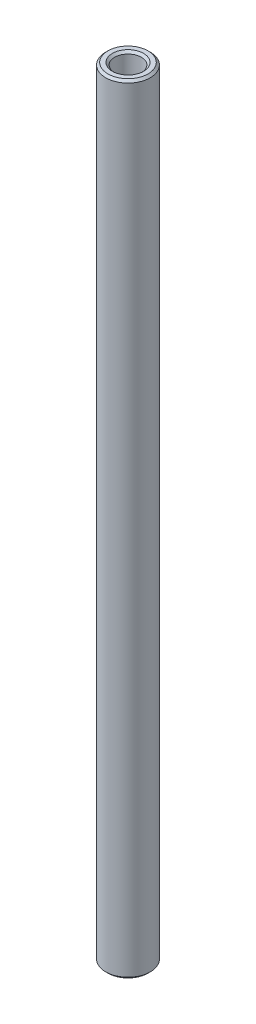
ISO-10303-21;
HEADER;
FILE_DESCRIPTION(('STEP AP214'),'2;1');
FILE_NAME('part.step','',(''),(''),'','','');
FILE_SCHEMA(('AUTOMOTIVE_DESIGN { 1 0 10303 214 1 1 1 1 }'));
ENDSEC;
DATA;
#1=APPLICATION_CONTEXT('core data for automotive mechanical design processes');
#2=APPLICATION_PROTOCOL_DEFINITION('international standard','automotive_design',2000,#1);
#3=PRODUCT_CONTEXT('',#1,'mechanical');
#4=PRODUCT('Part','Part','',(#3));
#5=PRODUCT_RELATED_PRODUCT_CATEGORY('part','',(#4));
#6=PRODUCT_DEFINITION_FORMATION('','',#4);
#7=PRODUCT_DEFINITION_CONTEXT('part definition',#1,'design');
#8=PRODUCT_DEFINITION('design','',#6,#7);
#9=PRODUCT_DEFINITION_SHAPE('','',#8);
#10=(LENGTH_UNIT() NAMED_UNIT(*) SI_UNIT(.MILLI.,.METRE.));
#11=(NAMED_UNIT(*) PLANE_ANGLE_UNIT() SI_UNIT($,.RADIAN.));
#12=(NAMED_UNIT(*) SI_UNIT($,.STERADIAN.) SOLID_ANGLE_UNIT());
#13=UNCERTAINTY_MEASURE_WITH_UNIT(LENGTH_MEASURE(1.E-05),#10,'distance_accuracy_value','');
#14=(GEOMETRIC_REPRESENTATION_CONTEXT(3) GLOBAL_UNCERTAINTY_ASSIGNED_CONTEXT((#13)) GLOBAL_UNIT_ASSIGNED_CONTEXT((#10,
#11,#12)) REPRESENTATION_CONTEXT('',''));
#15=CARTESIAN_POINT('',(0.,0.,0.));
#16=DIRECTION('',(0.,0.,1.));
#17=DIRECTION('',(1.,0.,0.));
#18=AXIS2_PLACEMENT_3D('',#15,#16,#17);
#19=CARTESIAN_POINT('',(0.,175.,0.));
#20=DIRECTION('',(0.,1.,0.));
#21=DIRECTION('',(0.,0.,1.));
#22=AXIS2_PLACEMENT_3D('',#19,#20,#21);
#23=PLANE('',#22);
#24=CARTESIAN_POINT('',(0.,175.,0.));
#25=DIRECTION('',(0.,1.,0.));
#26=DIRECTION('',(0.,0.,1.));
#27=AXIS2_PLACEMENT_3D('',#24,#25,#26);
#28=CIRCLE('',#27,4.49999999999999);
#29=CARTESIAN_POINT('',(0.,175.,4.49999999999999));
#30=VERTEX_POINT('',#29);
#31=EDGE_CURVE('E54',#30,#30,#28,.T.);
#32=ORIENTED_EDGE('',*,*,#31,.T.);
#33=EDGE_LOOP('',(#32));
#34=FACE_BOUND('',#33,.T.);
#35=CARTESIAN_POINT('',(0.,175.,0.));
#36=DIRECTION('',(0.,1.,0.));
#37=DIRECTION('',(0.,0.,1.));
#38=AXIS2_PLACEMENT_3D('',#35,#36,#37);
#39=CIRCLE('',#38,3.5);
#40=CARTESIAN_POINT('',(0.,175.,3.5));
#41=VERTEX_POINT('',#40);
#42=EDGE_CURVE('E57',#41,#41,#39,.F.);
#43=ORIENTED_EDGE('',*,*,#42,.T.);
#44=EDGE_LOOP('',(#43));
#45=FACE_BOUND('',#44,.T.);
#46=ADVANCED_FACE('F31',(#34,#45),#23,.T.);
#47=CARTESIAN_POINT('',(0.,155.,0.));
#48=DIRECTION('',(0.,1.,0.));
#49=DIRECTION('',(0.,0.,1.));
#50=AXIS2_PLACEMENT_3D('',#47,#48,#49);
#51=CYLINDRICAL_SURFACE('',#50,3.);
#52=CARTESIAN_POINT('',(0.,174.5,0.));
#53=DIRECTION('',(0.,1.,0.));
#54=DIRECTION('',(0.,0.,1.));
#55=AXIS2_PLACEMENT_3D('',#52,#53,#54);
#56=CIRCLE('',#55,3.);
#57=CARTESIAN_POINT('',(0.,174.5,3.));
#58=VERTEX_POINT('',#57);
#59=EDGE_CURVE('E60',#58,#58,#56,.T.);
#60=ORIENTED_EDGE('',*,*,#59,.T.);
#61=EDGE_LOOP('',(#60));
#62=FACE_BOUND('',#61,.T.);
#63=CARTESIAN_POINT('',(0.,155.,0.));
#64=DIRECTION('',(0.,1.,0.));
#65=DIRECTION('',(0.,0.,1.));
#66=AXIS2_PLACEMENT_3D('',#63,#64,#65);
#67=CIRCLE('',#66,3.);
#68=CARTESIAN_POINT('',(0.,155.,3.));
#69=VERTEX_POINT('',#68);
#70=EDGE_CURVE('E63',#69,#69,#67,.T.);
#71=ORIENTED_EDGE('',*,*,#70,.F.);
#72=EDGE_LOOP('',(#71));
#73=FACE_BOUND('',#72,.T.);
#74=ADVANCED_FACE('F87',(#62,#73),#51,.F.);
#75=CARTESIAN_POINT('',(0.,155.,0.));
#76=DIRECTION('',(0.,1.,0.));
#77=DIRECTION('',(0.,0.,1.));
#78=AXIS2_PLACEMENT_3D('',#75,#76,#77);
#79=PLANE('',#78);
#80=ORIENTED_EDGE('',*,*,#70,.T.);
#81=EDGE_LOOP('',(#80));
#82=FACE_BOUND('',#81,.T.);
#83=ADVANCED_FACE('F93',(#82),#79,.T.);
#84=CARTESIAN_POINT('',(0.,174.5,0.));
#85=DIRECTION('',(0.,1.,0.));
#86=DIRECTION('',(0.,0.,1.));
#87=AXIS2_PLACEMENT_3D('',#84,#85,#86);
#88=CONICAL_SURFACE('',#87,3.,0.78539816339745);
#89=ORIENTED_EDGE('',*,*,#42,.F.);
#90=EDGE_LOOP('',(#89));
#91=FACE_BOUND('',#90,.T.);
#92=ORIENTED_EDGE('',*,*,#59,.F.);
#93=EDGE_LOOP('',(#92));
#94=FACE_BOUND('',#93,.T.);
#95=ADVANCED_FACE('F98',(#91,#94),#88,.F.);
#96=CARTESIAN_POINT('',(0.,273.,0.));
#97=DIRECTION('',(0.,-1.,0.));
#98=DIRECTION('',(0.,0.,-1.));
#99=AXIS2_PLACEMENT_3D('',#96,#97,#98);
#100=CYLINDRICAL_SURFACE('',#99,5.);
#101=CARTESIAN_POINT('',(0.,174.5,0.));
#102=DIRECTION('',(0.,1.,0.));
#103=DIRECTION('',(0.,0.,1.));
#104=AXIS2_PLACEMENT_3D('',#101,#102,#103);
#105=CIRCLE('',#104,5.);
#106=CARTESIAN_POINT('',(0.,174.5,5.));
#107=VERTEX_POINT('',#106);
#108=EDGE_CURVE('E46',#107,#107,#105,.F.);
#109=ORIENTED_EDGE('',*,*,#108,.T.);
#110=EDGE_LOOP('',(#109));
#111=FACE_BOUND('',#110,.T.);
#112=CARTESIAN_POINT('',(0.,0.5,0.));
#113=DIRECTION('',(0.,1.,0.));
#114=DIRECTION('',(0.,0.,1.));
#115=AXIS2_PLACEMENT_3D('',#112,#113,#114);
#116=CIRCLE('',#115,5.);
#117=CARTESIAN_POINT('',(0.,0.5,5.));
#118=VERTEX_POINT('',#117);
#119=EDGE_CURVE('E51',#118,#118,#116,.T.);
#120=ORIENTED_EDGE('',*,*,#119,.T.);
#121=EDGE_LOOP('',(#120));
#122=FACE_BOUND('',#121,.T.);
#123=ADVANCED_FACE('F83',(#111,#122),#100,.T.);
#124=CARTESIAN_POINT('',(0.,20.,0.));
#125=DIRECTION('',(0.,-1.,0.));
#126=DIRECTION('',(0.,0.,-1.));
#127=AXIS2_PLACEMENT_3D('',#124,#125,#126);
#128=PLANE('',#127);
#129=CARTESIAN_POINT('',(0.,20.,0.));
#130=DIRECTION('',(0.,-1.,0.));
#131=DIRECTION('',(0.,0.,-1.));
#132=AXIS2_PLACEMENT_3D('',#129,#130,#131);
#133=CIRCLE('',#132,3.);
#134=CARTESIAN_POINT('',(0.,20.,-3.));
#135=VERTEX_POINT('',#134);
#136=EDGE_CURVE('E66',#135,#135,#133,.T.);
#137=ORIENTED_EDGE('',*,*,#136,.T.);
#138=EDGE_LOOP('',(#137));
#139=FACE_BOUND('',#138,.T.);
#140=ADVANCED_FACE('F70',(#139),#128,.T.);
#141=CARTESIAN_POINT('',(0.,20.,0.));
#142=DIRECTION('',(0.,-1.,0.));
#143=DIRECTION('',(0.,0.,-1.));
#144=AXIS2_PLACEMENT_3D('',#141,#142,#143);
#145=CYLINDRICAL_SURFACE('',#144,3.);
#146=CARTESIAN_POINT('',(0.,0.500000000000028,0.));
#147=DIRECTION('',(0.,1.,0.));
#148=DIRECTION('',(0.,0.,1.));
#149=AXIS2_PLACEMENT_3D('',#146,#147,#148);
#150=CIRCLE('',#149,3.);
#151=CARTESIAN_POINT('',(0.,0.500000000000028,3.));
#152=VERTEX_POINT('',#151);
#153=EDGE_CURVE('E42',#152,#152,#150,.F.);
#154=ORIENTED_EDGE('',*,*,#153,.T.);
#155=EDGE_LOOP('',(#154));
#156=FACE_BOUND('',#155,.T.);
#157=ORIENTED_EDGE('',*,*,#136,.F.);
#158=EDGE_LOOP('',(#157));
#159=FACE_BOUND('',#158,.T.);
#160=ADVANCED_FACE('F72',(#156,#159),#145,.F.);
#161=CARTESIAN_POINT('',(0.,0.,0.));
#162=DIRECTION('',(0.,1.,0.));
#163=DIRECTION('',(0.,0.,1.));
#164=AXIS2_PLACEMENT_3D('',#161,#162,#163);
#165=PLANE('',#164);
#166=CARTESIAN_POINT('',(0.,0.,0.));
#167=DIRECTION('',(0.,1.,0.));
#168=DIRECTION('',(0.,0.,1.));
#169=AXIS2_PLACEMENT_3D('',#166,#167,#168);
#170=CIRCLE('',#169,3.5);
#171=CARTESIAN_POINT('',(0.,0.,3.5));
#172=VERTEX_POINT('',#171);
#173=EDGE_CURVE('E10',#172,#172,#170,.T.);
#174=ORIENTED_EDGE('',*,*,#173,.T.);
#175=EDGE_LOOP('',(#174));
#176=FACE_BOUND('',#175,.T.);
#177=CARTESIAN_POINT('',(0.,0.,0.));
#178=DIRECTION('',(0.,1.,0.));
#179=DIRECTION('',(0.,0.,1.));
#180=AXIS2_PLACEMENT_3D('',#177,#178,#179);
#181=CIRCLE('',#180,4.49999999999999);
#182=CARTESIAN_POINT('',(0.,0.,4.49999999999999));
#183=VERTEX_POINT('',#182);
#184=EDGE_CURVE('E38',#183,#183,#181,.F.);
#185=ORIENTED_EDGE('',*,*,#184,.T.);
#186=EDGE_LOOP('',(#185));
#187=FACE_BOUND('',#186,.T.);
#188=ADVANCED_FACE('F74',(#176,#187),#165,.F.);
#189=CARTESIAN_POINT('',(0.,175.,0.));
#190=DIRECTION('',(0.,-1.,0.));
#191=DIRECTION('',(0.,0.,-1.));
#192=AXIS2_PLACEMENT_3D('',#189,#190,#191);
#193=CONICAL_SURFACE('',#192,4.49999999999999,0.785398163397458);
#194=ORIENTED_EDGE('',*,*,#108,.F.);
#195=EDGE_LOOP('',(#194));
#196=FACE_BOUND('',#195,.T.);
#197=ORIENTED_EDGE('',*,*,#31,.F.);
#198=EDGE_LOOP('',(#197));
#199=FACE_BOUND('',#198,.T.);
#200=ADVANCED_FACE('F81',(#196,#199),#193,.T.);
#201=CARTESIAN_POINT('',(0.,0.500000000000028,0.));
#202=DIRECTION('',(0.,-1.,0.));
#203=DIRECTION('',(0.,0.,-1.));
#204=AXIS2_PLACEMENT_3D('',#201,#202,#203);
#205=CONICAL_SURFACE('',#204,3.,0.785398163397423);
#206=ORIENTED_EDGE('',*,*,#173,.F.);
#207=EDGE_LOOP('',(#206));
#208=FACE_BOUND('',#207,.T.);
#209=ORIENTED_EDGE('',*,*,#153,.F.);
#210=EDGE_LOOP('',(#209));
#211=FACE_BOUND('',#210,.T.);
#212=ADVANCED_FACE('F103',(#208,#211),#205,.F.);
#213=CARTESIAN_POINT('',(0.,0.,0.));
#214=DIRECTION('',(0.,1.,0.));
#215=DIRECTION('',(0.,0.,1.));
#216=AXIS2_PLACEMENT_3D('',#213,#214,#215);
#217=CONICAL_SURFACE('',#216,4.49999999999999,0.785398163397458);
#218=ORIENTED_EDGE('',*,*,#119,.F.);
#219=EDGE_LOOP('',(#218));
#220=FACE_BOUND('',#219,.T.);
#221=ORIENTED_EDGE('',*,*,#184,.F.);
#222=EDGE_LOOP('',(#221));
#223=FACE_BOUND('',#222,.T.);
#224=ADVANCED_FACE('F33',(#220,#223),#217,.T.);
#225=CLOSED_SHELL('',(#46,#74,#83,#95,#123,#140,#160,#188,#200,#212,#224));
#226=MANIFOLD_SOLID_BREP('B2',#225);
#227=ADVANCED_BREP_SHAPE_REPRESENTATION('',(#18,#226),#14);
#228=SHAPE_DEFINITION_REPRESENTATION(#9,#227);
ENDSEC;
END-ISO-10303-21;
